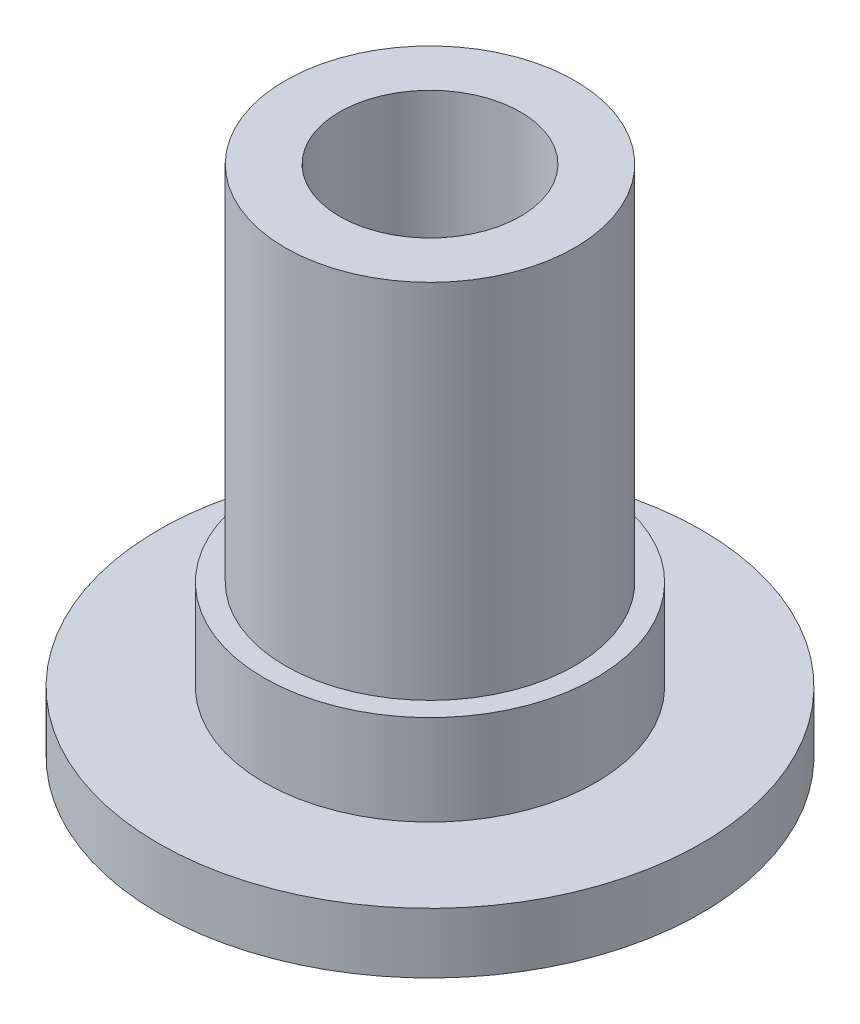
ISO-10303-21;
HEADER;
FILE_DESCRIPTION(('STEP AP214'),'2;1');
FILE_NAME('part.step','',(''),(''),'','','');
FILE_SCHEMA(('AUTOMOTIVE_DESIGN { 1 0 10303 214 1 1 1 1 }'));
ENDSEC;
DATA;
#1=APPLICATION_CONTEXT('core data for automotive mechanical design processes');
#2=APPLICATION_PROTOCOL_DEFINITION('international standard','automotive_design',2000,#1);
#3=PRODUCT_CONTEXT('',#1,'mechanical');
#4=PRODUCT('Part','Part','',(#3));
#5=PRODUCT_RELATED_PRODUCT_CATEGORY('part','',(#4));
#6=PRODUCT_DEFINITION_FORMATION('','',#4);
#7=PRODUCT_DEFINITION_CONTEXT('part definition',#1,'design');
#8=PRODUCT_DEFINITION('design','',#6,#7);
#9=PRODUCT_DEFINITION_SHAPE('','',#8);
#10=(LENGTH_UNIT() NAMED_UNIT(*) SI_UNIT(.MILLI.,.METRE.));
#11=(NAMED_UNIT(*) PLANE_ANGLE_UNIT() SI_UNIT($,.RADIAN.));
#12=(NAMED_UNIT(*) SI_UNIT($,.STERADIAN.) SOLID_ANGLE_UNIT());
#13=UNCERTAINTY_MEASURE_WITH_UNIT(LENGTH_MEASURE(1.E-05),#10,'distance_accuracy_value','');
#14=(GEOMETRIC_REPRESENTATION_CONTEXT(3) GLOBAL_UNCERTAINTY_ASSIGNED_CONTEXT((#13)) GLOBAL_UNIT_ASSIGNED_CONTEXT((#10,
#11,#12)) REPRESENTATION_CONTEXT('',''));
#15=CARTESIAN_POINT('',(0.,0.,0.));
#16=DIRECTION('',(0.,0.,1.));
#17=DIRECTION('',(1.,0.,0.));
#18=AXIS2_PLACEMENT_3D('',#15,#16,#17);
#19=CARTESIAN_POINT('',(0.,2.,0.));
#20=DIRECTION('',(0.,-1.,0.));
#21=DIRECTION('',(0.,0.,-1.));
#22=AXIS2_PLACEMENT_3D('',#19,#20,#21);
#23=CYLINDRICAL_SURFACE('',#22,9.);
#24=CARTESIAN_POINT('',(0.,2.,0.));
#25=DIRECTION('',(0.,1.,0.));
#26=DIRECTION('',(0.,0.,1.));
#27=AXIS2_PLACEMENT_3D('',#24,#25,#26);
#28=CIRCLE('',#27,9.);
#29=CARTESIAN_POINT('',(0.,2.,9.));
#30=VERTEX_POINT('',#29);
#31=EDGE_CURVE('E45',#30,#30,#28,.T.);
#32=ORIENTED_EDGE('',*,*,#31,.F.);
#33=EDGE_LOOP('',(#32));
#34=FACE_BOUND('',#33,.T.);
#35=CARTESIAN_POINT('',(0.,0.,0.));
#36=DIRECTION('',(0.,1.,0.));
#37=DIRECTION('',(0.,0.,1.));
#38=AXIS2_PLACEMENT_3D('',#35,#36,#37);
#39=CIRCLE('',#38,9.);
#40=CARTESIAN_POINT('',(0.,0.,9.));
#41=VERTEX_POINT('',#40);
#42=EDGE_CURVE('E36',#41,#41,#39,.T.);
#43=ORIENTED_EDGE('',*,*,#42,.T.);
#44=EDGE_LOOP('',(#43));
#45=FACE_BOUND('',#44,.T.);
#46=ADVANCED_FACE('F33',(#34,#45),#23,.T.);
#47=CARTESIAN_POINT('',(0.,2.,0.));
#48=DIRECTION('',(0.,1.,0.));
#49=DIRECTION('',(0.,0.,1.));
#50=AXIS2_PLACEMENT_3D('',#47,#48,#49);
#51=PLANE('',#50);
#52=CARTESIAN_POINT('',(0.,2.,0.));
#53=DIRECTION('',(0.,1.,0.));
#54=DIRECTION('',(0.,0.,1.));
#55=AXIS2_PLACEMENT_3D('',#52,#53,#54);
#56=CIRCLE('',#55,5.5);
#57=CARTESIAN_POINT('',(0.,2.,5.5));
#58=VERTEX_POINT('',#57);
#59=EDGE_CURVE('E40',#58,#58,#56,.T.);
#60=ORIENTED_EDGE('',*,*,#59,.F.);
#61=EDGE_LOOP('',(#60));
#62=FACE_BOUND('',#61,.T.);
#63=ORIENTED_EDGE('',*,*,#31,.T.);
#64=EDGE_LOOP('',(#63));
#65=FACE_BOUND('',#64,.T.);
#66=ADVANCED_FACE('F63',(#62,#65),#51,.T.);
#67=CARTESIAN_POINT('',(0.,0.,0.));
#68=DIRECTION('',(0.,1.,0.));
#69=DIRECTION('',(0.,0.,1.));
#70=AXIS2_PLACEMENT_3D('',#67,#68,#69);
#71=PLANE('',#70);
#72=CARTESIAN_POINT('',(0.,0.,0.));
#73=DIRECTION('',(0.,1.,0.));
#74=DIRECTION('',(0.,0.,1.));
#75=AXIS2_PLACEMENT_3D('',#72,#73,#74);
#76=CIRCLE('',#75,3.);
#77=CARTESIAN_POINT('',(0.,0.,3.));
#78=VERTEX_POINT('',#77);
#79=EDGE_CURVE('E130',#78,#78,#76,.T.);
#80=ORIENTED_EDGE('',*,*,#79,.T.);
#81=EDGE_LOOP('',(#80));
#82=FACE_BOUND('',#81,.T.);
#83=ORIENTED_EDGE('',*,*,#42,.F.);
#84=EDGE_LOOP('',(#83));
#85=FACE_BOUND('',#84,.T.);
#86=ADVANCED_FACE('F60',(#82,#85),#71,.F.);
#87=CARTESIAN_POINT('',(0.,5.,0.));
#88=DIRECTION('',(0.,-1.,0.));
#89=DIRECTION('',(0.,0.,-1.));
#90=AXIS2_PLACEMENT_3D('',#87,#88,#89);
#91=CYLINDRICAL_SURFACE('',#90,5.5);
#92=CARTESIAN_POINT('',(0.,5.,0.));
#93=DIRECTION('',(0.,1.,0.));
#94=DIRECTION('',(0.,0.,1.));
#95=AXIS2_PLACEMENT_3D('',#92,#93,#94);
#96=CIRCLE('',#95,5.5);
#97=CARTESIAN_POINT('',(0.,5.,5.5));
#98=VERTEX_POINT('',#97);
#99=EDGE_CURVE('E51',#98,#98,#96,.T.);
#100=ORIENTED_EDGE('',*,*,#99,.F.);
#101=EDGE_LOOP('',(#100));
#102=FACE_BOUND('',#101,.T.);
#103=ORIENTED_EDGE('',*,*,#59,.T.);
#104=EDGE_LOOP('',(#103));
#105=FACE_BOUND('',#104,.T.);
#106=ADVANCED_FACE('F62',(#102,#105),#91,.T.);
#107=CARTESIAN_POINT('',(0.,5.,0.));
#108=DIRECTION('',(0.,1.,0.));
#109=DIRECTION('',(0.,0.,1.));
#110=AXIS2_PLACEMENT_3D('',#107,#108,#109);
#111=PLANE('',#110);
#112=CARTESIAN_POINT('',(0.,5.,0.));
#113=DIRECTION('',(0.,1.,0.));
#114=DIRECTION('',(0.,0.,1.));
#115=AXIS2_PLACEMENT_3D('',#112,#113,#114);
#116=CIRCLE('',#115,4.8);
#117=CARTESIAN_POINT('',(0.,5.,4.8));
#118=VERTEX_POINT('',#117);
#119=EDGE_CURVE('E10',#118,#118,#116,.T.);
#120=ORIENTED_EDGE('',*,*,#119,.F.);
#121=EDGE_LOOP('',(#120));
#122=FACE_BOUND('',#121,.T.);
#123=ORIENTED_EDGE('',*,*,#99,.T.);
#124=EDGE_LOOP('',(#123));
#125=FACE_BOUND('',#124,.T.);
#126=ADVANCED_FACE('F70',(#122,#125),#111,.T.);
#127=CARTESIAN_POINT('',(0.,17.,0.));
#128=DIRECTION('',(0.,-1.,0.));
#129=DIRECTION('',(0.,0.,-1.));
#130=AXIS2_PLACEMENT_3D('',#127,#128,#129);
#131=CYLINDRICAL_SURFACE('',#130,4.8);
#132=CARTESIAN_POINT('',(0.,17.,0.));
#133=DIRECTION('',(0.,1.,0.));
#134=DIRECTION('',(0.,0.,1.));
#135=AXIS2_PLACEMENT_3D('',#132,#133,#134);
#136=CIRCLE('',#135,4.8);
#137=CARTESIAN_POINT('',(0.,17.,4.8));
#138=VERTEX_POINT('',#137);
#139=EDGE_CURVE('E49',#138,#138,#136,.T.);
#140=ORIENTED_EDGE('',*,*,#139,.F.);
#141=EDGE_LOOP('',(#140));
#142=FACE_BOUND('',#141,.T.);
#143=ORIENTED_EDGE('',*,*,#119,.T.);
#144=EDGE_LOOP('',(#143));
#145=FACE_BOUND('',#144,.T.);
#146=ADVANCED_FACE('F99',(#142,#145),#131,.T.);
#147=CARTESIAN_POINT('',(0.,17.,0.));
#148=DIRECTION('',(0.,1.,0.));
#149=DIRECTION('',(0.,0.,1.));
#150=AXIS2_PLACEMENT_3D('',#147,#148,#149);
#151=PLANE('',#150);
#152=CARTESIAN_POINT('',(0.,17.,0.));
#153=DIRECTION('',(0.,1.,0.));
#154=DIRECTION('',(0.,0.,1.));
#155=AXIS2_PLACEMENT_3D('',#152,#153,#154);
#156=CIRCLE('',#155,3.);
#157=CARTESIAN_POINT('',(0.,17.,3.));
#158=VERTEX_POINT('',#157);
#159=EDGE_CURVE('E133',#158,#158,#156,.T.);
#160=ORIENTED_EDGE('',*,*,#159,.F.);
#161=EDGE_LOOP('',(#160));
#162=FACE_BOUND('',#161,.T.);
#163=ORIENTED_EDGE('',*,*,#139,.T.);
#164=EDGE_LOOP('',(#163));
#165=FACE_BOUND('',#164,.T.);
#166=ADVANCED_FACE('F106',(#162,#165),#151,.T.);
#167=CARTESIAN_POINT('',(0.,0.,0.));
#168=DIRECTION('',(0.,1.,0.));
#169=DIRECTION('',(0.,0.,1.));
#170=AXIS2_PLACEMENT_3D('',#167,#168,#169);
#171=CYLINDRICAL_SURFACE('',#170,3.);
#172=ORIENTED_EDGE('',*,*,#79,.F.);
#173=EDGE_LOOP('',(#172));
#174=FACE_BOUND('',#173,.T.);
#175=ORIENTED_EDGE('',*,*,#159,.T.);
#176=EDGE_LOOP('',(#175));
#177=FACE_BOUND('',#176,.T.);
#178=ADVANCED_FACE('F114',(#174,#177),#171,.F.);
#179=CLOSED_SHELL('',(#46,#66,#86,#106,#126,#146,#166,#178));
#180=MANIFOLD_SOLID_BREP('B2',#179);
#181=ADVANCED_BREP_SHAPE_REPRESENTATION('',(#18,#180),#14);
#182=SHAPE_DEFINITION_REPRESENTATION(#9,#181);
ENDSEC;
END-ISO-10303-21;
